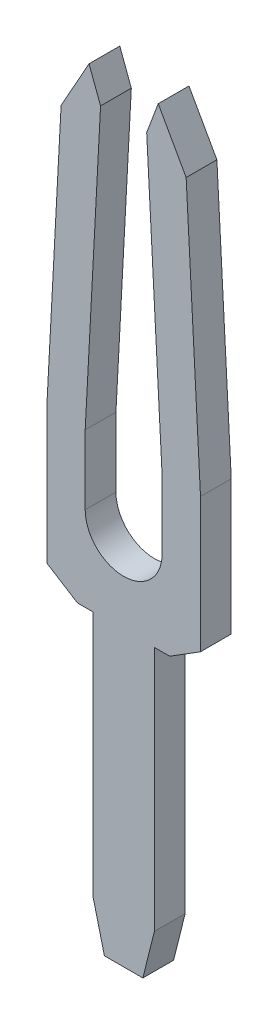
ISO-10303-21;
HEADER;
FILE_DESCRIPTION(('STEP AP214'),'2;1');
FILE_NAME('part.step','',(''),(''),'','','');
FILE_SCHEMA(('AUTOMOTIVE_DESIGN { 1 0 10303 214 1 1 1 1 }'));
ENDSEC;
DATA;
#1=APPLICATION_CONTEXT('core data for automotive mechanical design processes');
#2=APPLICATION_PROTOCOL_DEFINITION('international standard','automotive_design',2000,#1);
#3=PRODUCT_CONTEXT('',#1,'mechanical');
#4=PRODUCT('Part','Part','',(#3));
#5=PRODUCT_RELATED_PRODUCT_CATEGORY('part','',(#4));
#6=PRODUCT_DEFINITION_FORMATION('','',#4);
#7=PRODUCT_DEFINITION_CONTEXT('part definition',#1,'design');
#8=PRODUCT_DEFINITION('design','',#6,#7);
#9=PRODUCT_DEFINITION_SHAPE('','',#8);
#10=(LENGTH_UNIT() NAMED_UNIT(*) SI_UNIT(.MILLI.,.METRE.));
#11=(NAMED_UNIT(*) PLANE_ANGLE_UNIT() SI_UNIT($,.RADIAN.));
#12=(NAMED_UNIT(*) SI_UNIT($,.STERADIAN.) SOLID_ANGLE_UNIT());
#13=UNCERTAINTY_MEASURE_WITH_UNIT(LENGTH_MEASURE(1.E-05),#10,'distance_accuracy_value','');
#14=(GEOMETRIC_REPRESENTATION_CONTEXT(3) GLOBAL_UNCERTAINTY_ASSIGNED_CONTEXT((#13)) GLOBAL_UNIT_ASSIGNED_CONTEXT((#10,
#11,#12)) REPRESENTATION_CONTEXT('',''));
#15=CARTESIAN_POINT('',(0.,0.,0.));
#16=DIRECTION('',(0.,0.,1.));
#17=DIRECTION('',(1.,0.,0.));
#18=AXIS2_PLACEMENT_3D('',#15,#16,#17);
#19=CARTESIAN_POINT('',(-0.25,-4.975,0.4));
#20=DIRECTION('',(0.,1.,0.));
#21=DIRECTION('',(0.,0.,1.));
#22=AXIS2_PLACEMENT_3D('',#19,#20,#21);
#23=PLANE('',#22);
#24=DIRECTION('',(1.,0.,0.));
#25=VECTOR('',#24,1.);
#26=CARTESIAN_POINT('',(-0.25,-4.975,0.));
#27=LINE('',#26,#25);
#28=CARTESIAN_POINT('',(-0.25,-4.975,0.));
#29=VERTEX_POINT('',#28);
#30=CARTESIAN_POINT('',(0.25,-4.975,0.));
#31=VERTEX_POINT('',#30);
#32=EDGE_CURVE('E213',#29,#31,#27,.T.);
#33=ORIENTED_EDGE('',*,*,#32,.T.);
#34=DIRECTION('',(0.,0.,-1.));
#35=VECTOR('',#34,1.);
#36=CARTESIAN_POINT('',(0.25,-4.975,0.4));
#37=LINE('',#36,#35);
#38=CARTESIAN_POINT('',(0.25,-4.975,0.4));
#39=VERTEX_POINT('',#38);
#40=EDGE_CURVE('E11',#39,#31,#37,.T.);
#41=ORIENTED_EDGE('',*,*,#40,.F.);
#42=DIRECTION('',(1.,0.,0.));
#43=VECTOR('',#42,1.);
#44=CARTESIAN_POINT('',(-0.25,-4.975,0.4));
#45=LINE('',#44,#43);
#46=CARTESIAN_POINT('',(-0.25,-4.975,0.4));
#47=VERTEX_POINT('',#46);
#48=EDGE_CURVE('E255',#47,#39,#45,.T.);
#49=ORIENTED_EDGE('',*,*,#48,.F.);
#50=DIRECTION('',(0.,0.,-1.));
#51=VECTOR('',#50,1.);
#52=CARTESIAN_POINT('',(-0.25,-4.975,0.4));
#53=LINE('',#52,#51);
#54=EDGE_CURVE('E209',#47,#29,#53,.T.);
#55=ORIENTED_EDGE('',*,*,#54,.T.);
#56=EDGE_LOOP('',(#33,#41,#49,#55));
#57=FACE_BOUND('',#56,.T.);
#58=ADVANCED_FACE('F33',(#57),#23,.F.);
#59=CARTESIAN_POINT('',(0.25,-4.975,0.4));
#60=DIRECTION('',(-0.970142500145333,0.242535625036329,0.));
#61=DIRECTION('',(-0.242535625036329,-0.970142500145333,0.));
#62=AXIS2_PLACEMENT_3D('',#59,#60,#61);
#63=PLANE('',#62);
#64=DIRECTION('',(0.242535625036329,0.970142500145333,0.));
#65=VECTOR('',#64,1.);
#66=CARTESIAN_POINT('',(0.25,-4.975,0.));
#67=LINE('',#66,#65);
#68=CARTESIAN_POINT('',(0.399999999999998,-4.375,0.));
#69=VERTEX_POINT('',#68);
#70=EDGE_CURVE('E216',#31,#69,#67,.T.);
#71=ORIENTED_EDGE('',*,*,#70,.T.);
#72=DIRECTION('',(0.,0.,-1.));
#73=VECTOR('',#72,1.);
#74=CARTESIAN_POINT('',(0.399999999999998,-4.375,0.4));
#75=LINE('',#74,#73);
#76=CARTESIAN_POINT('',(0.399999999999998,-4.375,0.4));
#77=VERTEX_POINT('',#76);
#78=EDGE_CURVE('E41',#77,#69,#75,.T.);
#79=ORIENTED_EDGE('',*,*,#78,.F.);
#80=DIRECTION('',(0.242535625036329,0.970142500145333,0.));
#81=VECTOR('',#80,1.);
#82=CARTESIAN_POINT('',(0.25,-4.975,0.4));
#83=LINE('',#82,#81);
#84=EDGE_CURVE('E134',#39,#77,#83,.T.);
#85=ORIENTED_EDGE('',*,*,#84,.F.);
#86=ORIENTED_EDGE('',*,*,#40,.T.);
#87=EDGE_LOOP('',(#71,#79,#85,#86));
#88=FACE_BOUND('',#87,.T.);
#89=ADVANCED_FACE('F383',(#88),#63,.F.);
#90=CARTESIAN_POINT('',(0.399999999999998,-4.375,0.4));
#91=DIRECTION('',(-1.,0.,0.));
#92=DIRECTION('',(0.,0.,1.));
#93=AXIS2_PLACEMENT_3D('',#90,#91,#92);
#94=PLANE('',#93);
#95=DIRECTION('',(0.,1.,0.));
#96=VECTOR('',#95,1.);
#97=CARTESIAN_POINT('',(0.399999999999998,-4.375,0.));
#98=LINE('',#97,#96);
#99=CARTESIAN_POINT('',(0.399999999999998,-1.175,0.));
#100=VERTEX_POINT('',#99);
#101=EDGE_CURVE('E218',#69,#100,#98,.T.);
#102=ORIENTED_EDGE('',*,*,#101,.T.);
#103=DIRECTION('',(0.,0.,-1.));
#104=VECTOR('',#103,1.);
#105=CARTESIAN_POINT('',(0.399999999999998,-1.175,0.4));
#106=LINE('',#105,#104);
#107=CARTESIAN_POINT('',(0.399999999999998,-1.175,0.4));
#108=VERTEX_POINT('',#107);
#109=EDGE_CURVE('E304',#108,#100,#106,.T.);
#110=ORIENTED_EDGE('',*,*,#109,.F.);
#111=DIRECTION('',(0.,1.,0.));
#112=VECTOR('',#111,1.);
#113=CARTESIAN_POINT('',(0.399999999999998,-4.375,0.4));
#114=LINE('',#113,#112);
#115=EDGE_CURVE('E312',#77,#108,#114,.T.);
#116=ORIENTED_EDGE('',*,*,#115,.F.);
#117=ORIENTED_EDGE('',*,*,#78,.T.);
#118=EDGE_LOOP('',(#102,#110,#116,#117));
#119=FACE_BOUND('',#118,.T.);
#120=ADVANCED_FACE('F310',(#119),#94,.F.);
#121=CARTESIAN_POINT('',(0.399999999999998,-1.175,0.4));
#122=DIRECTION('',(0.,1.,0.));
#123=DIRECTION('',(0.,0.,1.));
#124=AXIS2_PLACEMENT_3D('',#121,#122,#123);
#125=PLANE('',#124);
#126=DIRECTION('',(1.,0.,0.));
#127=VECTOR('',#126,1.);
#128=CARTESIAN_POINT('',(0.399999999999998,-1.175,0.));
#129=LINE('',#128,#127);
#130=CARTESIAN_POINT('',(0.600000000000003,-1.175,0.));
#131=VERTEX_POINT('',#130);
#132=EDGE_CURVE('E220',#100,#131,#129,.T.);
#133=ORIENTED_EDGE('',*,*,#132,.T.);
#134=DIRECTION('',(0.,0.,-1.));
#135=VECTOR('',#134,1.);
#136=CARTESIAN_POINT('',(0.600000000000003,-1.175,0.4));
#137=LINE('',#136,#135);
#138=CARTESIAN_POINT('',(0.600000000000003,-1.175,0.4));
#139=VERTEX_POINT('',#138);
#140=EDGE_CURVE('E301',#139,#131,#137,.T.);
#141=ORIENTED_EDGE('',*,*,#140,.F.);
#142=DIRECTION('',(1.,0.,0.));
#143=VECTOR('',#142,1.);
#144=CARTESIAN_POINT('',(0.399999999999998,-1.175,0.4));
#145=LINE('',#144,#143);
#146=EDGE_CURVE('E330',#108,#139,#145,.T.);
#147=ORIENTED_EDGE('',*,*,#146,.F.);
#148=ORIENTED_EDGE('',*,*,#109,.T.);
#149=EDGE_LOOP('',(#133,#141,#147,#148));
#150=FACE_BOUND('',#149,.T.);
#151=ADVANCED_FACE('F321',(#150),#125,.F.);
#152=CARTESIAN_POINT('',(0.600000000000003,-1.175,0.4));
#153=DIRECTION('',(-0.529998940003182,0.847998304005086,0.));
#154=DIRECTION('',(-0.847998304005087,-0.529998940003182,0.));
#155=AXIS2_PLACEMENT_3D('',#152,#153,#154);
#156=PLANE('',#155);
#157=DIRECTION('',(0.847998304005086,0.529998940003182,0.));
#158=VECTOR('',#157,1.);
#159=CARTESIAN_POINT('',(0.600000000000003,-1.175,0.));
#160=LINE('',#159,#158);
#161=CARTESIAN_POINT('',(1.,-0.925,0.));
#162=VERTEX_POINT('',#161);
#163=EDGE_CURVE('E222',#131,#162,#160,.T.);
#164=ORIENTED_EDGE('',*,*,#163,.T.);
#165=DIRECTION('',(0.,0.,-1.));
#166=VECTOR('',#165,1.);
#167=CARTESIAN_POINT('',(1.,-0.925,0.4));
#168=LINE('',#167,#166);
#169=CARTESIAN_POINT('',(1.,-0.925,0.4));
#170=VERTEX_POINT('',#169);
#171=EDGE_CURVE('E298',#170,#162,#168,.T.);
#172=ORIENTED_EDGE('',*,*,#171,.F.);
#173=DIRECTION('',(0.847998304005086,0.529998940003182,0.));
#174=VECTOR('',#173,1.);
#175=CARTESIAN_POINT('',(0.600000000000003,-1.175,0.4));
#176=LINE('',#175,#174);
#177=EDGE_CURVE('E327',#139,#170,#176,.T.);
#178=ORIENTED_EDGE('',*,*,#177,.F.);
#179=ORIENTED_EDGE('',*,*,#140,.T.);
#180=EDGE_LOOP('',(#164,#172,#178,#179));
#181=FACE_BOUND('',#180,.T.);
#182=ADVANCED_FACE('F325',(#181),#156,.F.);
#183=CARTESIAN_POINT('',(1.,-0.925,0.4));
#184=DIRECTION('',(-1.,0.,0.));
#185=DIRECTION('',(0.,0.,1.));
#186=AXIS2_PLACEMENT_3D('',#183,#184,#185);
#187=PLANE('',#186);
#188=DIRECTION('',(0.,1.,0.));
#189=VECTOR('',#188,1.);
#190=CARTESIAN_POINT('',(1.,-0.925,0.));
#191=LINE('',#190,#189);
#192=CARTESIAN_POINT('',(1.,0.825,0.));
#193=VERTEX_POINT('',#192);
#194=EDGE_CURVE('E224',#162,#193,#191,.T.);
#195=ORIENTED_EDGE('',*,*,#194,.T.);
#196=DIRECTION('',(0.,0.,-1.));
#197=VECTOR('',#196,1.);
#198=CARTESIAN_POINT('',(1.,0.825,0.4));
#199=LINE('',#198,#197);
#200=CARTESIAN_POINT('',(1.,0.825,0.4));
#201=VERTEX_POINT('',#200);
#202=EDGE_CURVE('E295',#201,#193,#199,.T.);
#203=ORIENTED_EDGE('',*,*,#202,.F.);
#204=DIRECTION('',(0.,1.,0.));
#205=VECTOR('',#204,1.);
#206=CARTESIAN_POINT('',(1.,-0.925,0.4));
#207=LINE('',#206,#205);
#208=EDGE_CURVE('E329',#170,#201,#207,.T.);
#209=ORIENTED_EDGE('',*,*,#208,.F.);
#210=ORIENTED_EDGE('',*,*,#171,.T.);
#211=EDGE_LOOP('',(#195,#203,#209,#210));
#212=FACE_BOUND('',#211,.T.);
#213=ADVANCED_FACE('F396',(#212),#187,.F.);
#214=CARTESIAN_POINT('',(1.,0.825,0.4));
#215=DIRECTION('',(-0.998580804677827,-0.0532576429161334,0.));
#216=DIRECTION('',(0.0532576429161335,-0.998580804677828,0.));
#217=AXIS2_PLACEMENT_3D('',#214,#215,#216);
#218=PLANE('',#217);
#219=DIRECTION('',(-0.0532576429161335,0.998580804677828,0.));
#220=VECTOR('',#219,1.);
#221=CARTESIAN_POINT('',(1.,0.825,0.));
#222=LINE('',#221,#220);
#223=CARTESIAN_POINT('',(0.813333333333395,4.325,0.));
#224=VERTEX_POINT('',#223);
#225=EDGE_CURVE('E226',#193,#224,#222,.T.);
#226=ORIENTED_EDGE('',*,*,#225,.T.);
#227=DIRECTION('',(0.,0.,-1.));
#228=VECTOR('',#227,1.);
#229=CARTESIAN_POINT('',(0.813333333333395,4.325,0.4));
#230=LINE('',#229,#228);
#231=CARTESIAN_POINT('',(0.813333333333395,4.325,0.4));
#232=VERTEX_POINT('',#231);
#233=EDGE_CURVE('E292',#232,#224,#230,.T.);
#234=ORIENTED_EDGE('',*,*,#233,.F.);
#235=DIRECTION('',(-0.0532576429161335,0.998580804677828,0.));
#236=VECTOR('',#235,1.);
#237=CARTESIAN_POINT('',(1.,0.825,0.4));
#238=LINE('',#237,#236);
#239=EDGE_CURVE('E332',#201,#232,#238,.T.);
#240=ORIENTED_EDGE('',*,*,#239,.F.);
#241=ORIENTED_EDGE('',*,*,#202,.T.);
#242=EDGE_LOOP('',(#226,#234,#240,#241));
#243=FACE_BOUND('',#242,.T.);
#244=ADVANCED_FACE('F399',(#243),#218,.F.);
#245=CARTESIAN_POINT('',(0.813333333333395,4.325,0.4));
#246=DIRECTION('',(-0.872887411396182,-0.487921681242053,0.));
#247=DIRECTION('',(0.487921681242053,-0.872887411396182,0.));
#248=AXIS2_PLACEMENT_3D('',#245,#246,#247);
#249=PLANE('',#248);
#250=DIRECTION('',(-0.487921681242053,0.872887411396182,0.));
#251=VECTOR('',#250,1.);
#252=CARTESIAN_POINT('',(0.813333333333395,4.325,0.));
#253=LINE('',#252,#251);
#254=CARTESIAN_POINT('',(0.449999999999999,4.975,0.));
#255=VERTEX_POINT('',#254);
#256=EDGE_CURVE('E228',#224,#255,#253,.T.);
#257=ORIENTED_EDGE('',*,*,#256,.T.);
#258=DIRECTION('',(0.,0.,-1.));
#259=VECTOR('',#258,1.);
#260=CARTESIAN_POINT('',(0.449999999999999,4.975,0.4));
#261=LINE('',#260,#259);
#262=CARTESIAN_POINT('',(0.449999999999999,4.975,0.4));
#263=VERTEX_POINT('',#262);
#264=EDGE_CURVE('E289',#263,#255,#261,.T.);
#265=ORIENTED_EDGE('',*,*,#264,.F.);
#266=DIRECTION('',(-0.487921681242053,0.872887411396182,0.));
#267=VECTOR('',#266,1.);
#268=CARTESIAN_POINT('',(0.813333333333395,4.325,0.4));
#269=LINE('',#268,#267);
#270=EDGE_CURVE('E338',#232,#263,#269,.T.);
#271=ORIENTED_EDGE('',*,*,#270,.F.);
#272=ORIENTED_EDGE('',*,*,#233,.T.);
#273=EDGE_LOOP('',(#257,#265,#271,#272));
#274=FACE_BOUND('',#273,.T.);
#275=ADVANCED_FACE('F403',(#274),#249,.F.);
#276=CARTESIAN_POINT('',(0.449999999999999,4.975,0.4));
#277=DIRECTION('',(0.936329177569047,-0.351123441588386,0.));
#278=DIRECTION('',(0.351123441588386,0.936329177569047,0.));
#279=AXIS2_PLACEMENT_3D('',#276,#277,#278);
#280=PLANE('',#279);
#281=DIRECTION('',(-0.351123441588386,-0.936329177569047,0.));
#282=VECTOR('',#281,1.);
#283=CARTESIAN_POINT('',(0.449999999999999,4.975,0.));
#284=LINE('',#283,#282);
#285=CARTESIAN_POINT('',(0.300000000000002,4.575,0.));
#286=VERTEX_POINT('',#285);
#287=EDGE_CURVE('E230',#255,#286,#284,.T.);
#288=ORIENTED_EDGE('',*,*,#287,.T.);
#289=DIRECTION('',(0.,0.,-1.));
#290=VECTOR('',#289,1.);
#291=CARTESIAN_POINT('',(0.300000000000002,4.575,0.4));
#292=LINE('',#291,#290);
#293=CARTESIAN_POINT('',(0.300000000000002,4.575,0.4));
#294=VERTEX_POINT('',#293);
#295=EDGE_CURVE('E286',#294,#286,#292,.T.);
#296=ORIENTED_EDGE('',*,*,#295,.F.);
#297=DIRECTION('',(-0.351123441588386,-0.936329177569047,0.));
#298=VECTOR('',#297,1.);
#299=CARTESIAN_POINT('',(0.449999999999999,4.975,0.4));
#300=LINE('',#299,#298);
#301=EDGE_CURVE('E340',#263,#294,#300,.T.);
#302=ORIENTED_EDGE('',*,*,#301,.F.);
#303=ORIENTED_EDGE('',*,*,#264,.T.);
#304=EDGE_LOOP('',(#288,#296,#302,#303));
#305=FACE_BOUND('',#304,.T.);
#306=ADVANCED_FACE('F407',(#305),#280,.F.);
#307=CARTESIAN_POINT('',(0.300000000000002,4.575,0.4));
#308=DIRECTION('',(0.998580804677827,0.0532576429161504,0.));
#309=DIRECTION('',(-0.0532576429161504,0.998580804677827,0.));
#310=AXIS2_PLACEMENT_3D('',#307,#308,#309);
#311=PLANE('',#310);
#312=DIRECTION('',(0.0532576429161504,-0.998580804677827,0.));
#313=VECTOR('',#312,1.);
#314=CARTESIAN_POINT('',(0.300000000000002,4.575,0.));
#315=LINE('',#314,#313);
#316=CARTESIAN_POINT('',(0.5,0.825,0.));
#317=VERTEX_POINT('',#316);
#318=EDGE_CURVE('E232',#286,#317,#315,.T.);
#319=ORIENTED_EDGE('',*,*,#318,.T.);
#320=DIRECTION('',(0.,0.,-1.));
#321=VECTOR('',#320,1.);
#322=CARTESIAN_POINT('',(0.5,0.825,0.4));
#323=LINE('',#322,#321);
#324=CARTESIAN_POINT('',(0.5,0.825,0.4));
#325=VERTEX_POINT('',#324);
#326=EDGE_CURVE('E283',#325,#317,#323,.T.);
#327=ORIENTED_EDGE('',*,*,#326,.F.);
#328=DIRECTION('',(0.0532576429161504,-0.998580804677827,0.));
#329=VECTOR('',#328,1.);
#330=CARTESIAN_POINT('',(0.300000000000002,4.575,0.4));
#331=LINE('',#330,#329);
#332=EDGE_CURVE('E342',#294,#325,#331,.T.);
#333=ORIENTED_EDGE('',*,*,#332,.F.);
#334=ORIENTED_EDGE('',*,*,#295,.T.);
#335=EDGE_LOOP('',(#319,#327,#333,#334));
#336=FACE_BOUND('',#335,.T.);
#337=ADVANCED_FACE('F411',(#336),#311,.F.);
#338=CARTESIAN_POINT('',(0.5,0.825,0.4));
#339=DIRECTION('',(1.,0.,0.));
#340=DIRECTION('',(0.,0.,-1.));
#341=AXIS2_PLACEMENT_3D('',#338,#339,#340);
#342=PLANE('',#341);
#343=DIRECTION('',(0.,-1.,0.));
#344=VECTOR('',#343,1.);
#345=CARTESIAN_POINT('',(0.5,0.825,0.));
#346=LINE('',#345,#344);
#347=CARTESIAN_POINT('',(0.5,-0.075,0.));
#348=VERTEX_POINT('',#347);
#349=EDGE_CURVE('E234',#317,#348,#346,.T.);
#350=ORIENTED_EDGE('',*,*,#349,.T.);
#351=DIRECTION('',(0.,0.,-1.));
#352=VECTOR('',#351,1.);
#353=CARTESIAN_POINT('',(0.5,-0.075,0.4));
#354=LINE('',#353,#352);
#355=CARTESIAN_POINT('',(0.5,-0.075,0.4));
#356=VERTEX_POINT('',#355);
#357=EDGE_CURVE('E280',#356,#348,#354,.T.);
#358=ORIENTED_EDGE('',*,*,#357,.F.);
#359=DIRECTION('',(0.,-1.,0.));
#360=VECTOR('',#359,1.);
#361=CARTESIAN_POINT('',(0.5,0.825,0.4));
#362=LINE('',#361,#360);
#363=EDGE_CURVE('E344',#325,#356,#362,.T.);
#364=ORIENTED_EDGE('',*,*,#363,.F.);
#365=ORIENTED_EDGE('',*,*,#326,.T.);
#366=EDGE_LOOP('',(#350,#358,#364,#365));
#367=FACE_BOUND('',#366,.T.);
#368=ADVANCED_FACE('F415',(#367),#342,.F.);
#369=CARTESIAN_POINT('',(0.,-0.075,0.4));
#370=DIRECTION('',(0.,0.,-1.));
#371=DIRECTION('',(-1.,0.,0.));
#372=AXIS2_PLACEMENT_3D('',#369,#370,#371);
#373=CYLINDRICAL_SURFACE('',#372,0.5);
#374=CARTESIAN_POINT('',(0.,-0.075,0.));
#375=DIRECTION('',(0.,0.,-1.));
#376=DIRECTION('',(1.,0.,0.));
#377=AXIS2_PLACEMENT_3D('',#374,#375,#376);
#378=CIRCLE('',#377,0.5);
#379=CARTESIAN_POINT('',(-0.5,-0.0749999999999999,0.));
#380=VERTEX_POINT('',#379);
#381=EDGE_CURVE('E236',#348,#380,#378,.T.);
#382=ORIENTED_EDGE('',*,*,#381,.T.);
#383=DIRECTION('',(0.,0.,-1.));
#384=VECTOR('',#383,1.);
#385=CARTESIAN_POINT('',(-0.5,-0.0749999999999999,0.4));
#386=LINE('',#385,#384);
#387=CARTESIAN_POINT('',(-0.5,-0.0749999999999999,0.4));
#388=VERTEX_POINT('',#387);
#389=EDGE_CURVE('E277',#388,#380,#386,.T.);
#390=ORIENTED_EDGE('',*,*,#389,.F.);
#391=CARTESIAN_POINT('',(0.,-0.075,0.4));
#392=DIRECTION('',(0.,0.,-1.));
#393=DIRECTION('',(1.,0.,0.));
#394=AXIS2_PLACEMENT_3D('',#391,#392,#393);
#395=CIRCLE('',#394,0.5);
#396=EDGE_CURVE('E346',#356,#388,#395,.T.);
#397=ORIENTED_EDGE('',*,*,#396,.F.);
#398=ORIENTED_EDGE('',*,*,#357,.T.);
#399=EDGE_LOOP('',(#382,#390,#397,#398));
#400=FACE_BOUND('',#399,.T.);
#401=ADVANCED_FACE('F419',(#400),#373,.F.);
#402=CARTESIAN_POINT('',(-0.5,-0.075,0.4));
#403=DIRECTION('',(-1.,0.,0.));
#404=DIRECTION('',(0.,0.,1.));
#405=AXIS2_PLACEMENT_3D('',#402,#403,#404);
#406=PLANE('',#405);
#407=DIRECTION('',(0.,1.,0.));
#408=VECTOR('',#407,1.);
#409=CARTESIAN_POINT('',(-0.5,-0.075,0.));
#410=LINE('',#409,#408);
#411=CARTESIAN_POINT('',(-0.5,0.825,0.));
#412=VERTEX_POINT('',#411);
#413=EDGE_CURVE('E238',#380,#412,#410,.T.);
#414=ORIENTED_EDGE('',*,*,#413,.T.);
#415=DIRECTION('',(0.,0.,-1.));
#416=VECTOR('',#415,1.);
#417=CARTESIAN_POINT('',(-0.5,0.825,0.4));
#418=LINE('',#417,#416);
#419=CARTESIAN_POINT('',(-0.5,0.825,0.4));
#420=VERTEX_POINT('',#419);
#421=EDGE_CURVE('E274',#420,#412,#418,.T.);
#422=ORIENTED_EDGE('',*,*,#421,.F.);
#423=DIRECTION('',(0.,1.,0.));
#424=VECTOR('',#423,1.);
#425=CARTESIAN_POINT('',(-0.5,-0.075,0.4));
#426=LINE('',#425,#424);
#427=EDGE_CURVE('E348',#388,#420,#426,.T.);
#428=ORIENTED_EDGE('',*,*,#427,.F.);
#429=ORIENTED_EDGE('',*,*,#389,.T.);
#430=EDGE_LOOP('',(#414,#422,#428,#429));
#431=FACE_BOUND('',#430,.T.);
#432=ADVANCED_FACE('F423',(#431),#406,.F.);
#433=CARTESIAN_POINT('',(-0.5,0.825,0.4));
#434=DIRECTION('',(-0.998580804677827,0.0532576429161504,0.));
#435=DIRECTION('',(-0.0532576429161504,-0.998580804677827,0.));
#436=AXIS2_PLACEMENT_3D('',#433,#434,#435);
#437=PLANE('',#436);
#438=DIRECTION('',(0.0532576429161504,0.998580804677827,0.));
#439=VECTOR('',#438,1.);
#440=CARTESIAN_POINT('',(-0.5,0.825,0.));
#441=LINE('',#440,#439);
#442=CARTESIAN_POINT('',(-0.300000000000002,4.575,0.));
#443=VERTEX_POINT('',#442);
#444=EDGE_CURVE('E240',#412,#443,#441,.T.);
#445=ORIENTED_EDGE('',*,*,#444,.T.);
#446=DIRECTION('',(0.,0.,-1.));
#447=VECTOR('',#446,1.);
#448=CARTESIAN_POINT('',(-0.300000000000002,4.575,0.4));
#449=LINE('',#448,#447);
#450=CARTESIAN_POINT('',(-0.300000000000002,4.575,0.4));
#451=VERTEX_POINT('',#450);
#452=EDGE_CURVE('E271',#451,#443,#449,.T.);
#453=ORIENTED_EDGE('',*,*,#452,.F.);
#454=DIRECTION('',(0.0532576429161504,0.998580804677827,0.));
#455=VECTOR('',#454,1.);
#456=CARTESIAN_POINT('',(-0.5,0.825,0.4));
#457=LINE('',#456,#455);
#458=EDGE_CURVE('E350',#420,#451,#457,.T.);
#459=ORIENTED_EDGE('',*,*,#458,.F.);
#460=ORIENTED_EDGE('',*,*,#421,.T.);
#461=EDGE_LOOP('',(#445,#453,#459,#460));
#462=FACE_BOUND('',#461,.T.);
#463=ADVANCED_FACE('F427',(#462),#437,.F.);
#464=CARTESIAN_POINT('',(-0.300000000000002,4.575,0.4));
#465=DIRECTION('',(-0.936329177569047,-0.351123441588386,0.));
#466=DIRECTION('',(0.351123441588386,-0.936329177569047,0.));
#467=AXIS2_PLACEMENT_3D('',#464,#465,#466);
#468=PLANE('',#467);
#469=DIRECTION('',(-0.351123441588386,0.936329177569047,0.));
#470=VECTOR('',#469,1.);
#471=CARTESIAN_POINT('',(-0.300000000000002,4.575,0.));
#472=LINE('',#471,#470);
#473=CARTESIAN_POINT('',(-0.449999999999999,4.975,0.));
#474=VERTEX_POINT('',#473);
#475=EDGE_CURVE('E242',#443,#474,#472,.T.);
#476=ORIENTED_EDGE('',*,*,#475,.T.);
#477=DIRECTION('',(0.,0.,-1.));
#478=VECTOR('',#477,1.);
#479=CARTESIAN_POINT('',(-0.449999999999999,4.975,0.4));
#480=LINE('',#479,#478);
#481=CARTESIAN_POINT('',(-0.449999999999999,4.975,0.4));
#482=VERTEX_POINT('',#481);
#483=EDGE_CURVE('E268',#482,#474,#480,.T.);
#484=ORIENTED_EDGE('',*,*,#483,.F.);
#485=DIRECTION('',(-0.351123441588386,0.936329177569047,0.));
#486=VECTOR('',#485,1.);
#487=CARTESIAN_POINT('',(-0.300000000000002,4.575,0.4));
#488=LINE('',#487,#486);
#489=EDGE_CURVE('E352',#451,#482,#488,.T.);
#490=ORIENTED_EDGE('',*,*,#489,.F.);
#491=ORIENTED_EDGE('',*,*,#452,.T.);
#492=EDGE_LOOP('',(#476,#484,#490,#491));
#493=FACE_BOUND('',#492,.T.);
#494=ADVANCED_FACE('F431',(#493),#468,.F.);
#495=CARTESIAN_POINT('',(-0.449999999999999,4.975,0.4));
#496=DIRECTION('',(0.872887411396234,-0.487921681241961,0.));
#497=DIRECTION('',(0.487921681241961,0.872887411396234,0.));
#498=AXIS2_PLACEMENT_3D('',#495,#496,#497);
#499=PLANE('',#498);
#500=DIRECTION('',(-0.487921681241961,-0.872887411396234,0.));
#501=VECTOR('',#500,1.);
#502=CARTESIAN_POINT('',(-0.449999999999999,4.975,0.));
#503=LINE('',#502,#501);
#504=CARTESIAN_POINT('',(-0.813333333333305,4.325,0.));
#505=VERTEX_POINT('',#504);
#506=EDGE_CURVE('E244',#474,#505,#503,.T.);
#507=ORIENTED_EDGE('',*,*,#506,.T.);
#508=DIRECTION('',(0.,0.,-1.));
#509=VECTOR('',#508,1.);
#510=CARTESIAN_POINT('',(-0.813333333333305,4.325,0.4));
#511=LINE('',#510,#509);
#512=CARTESIAN_POINT('',(-0.813333333333305,4.325,0.4));
#513=VERTEX_POINT('',#512);
#514=EDGE_CURVE('E265',#513,#505,#511,.T.);
#515=ORIENTED_EDGE('',*,*,#514,.F.);
#516=DIRECTION('',(-0.487921681241961,-0.872887411396234,0.));
#517=VECTOR('',#516,1.);
#518=CARTESIAN_POINT('',(-0.449999999999999,4.975,0.4));
#519=LINE('',#518,#517);
#520=EDGE_CURVE('E354',#482,#513,#519,.T.);
#521=ORIENTED_EDGE('',*,*,#520,.F.);
#522=ORIENTED_EDGE('',*,*,#483,.T.);
#523=EDGE_LOOP('',(#507,#515,#521,#522));
#524=FACE_BOUND('',#523,.T.);
#525=ADVANCED_FACE('F435',(#524),#499,.F.);
#526=CARTESIAN_POINT('',(-0.813333333333305,4.325,0.4));
#527=DIRECTION('',(0.998580804677826,-0.0532576429161591,0.));
#528=DIRECTION('',(0.0532576429161591,0.998580804677826,0.));
#529=AXIS2_PLACEMENT_3D('',#526,#527,#528);
#530=PLANE('',#529);
#531=DIRECTION('',(-0.0532576429161591,-0.998580804677826,0.));
#532=VECTOR('',#531,1.);
#533=CARTESIAN_POINT('',(-0.813333333333305,4.325,0.));
#534=LINE('',#533,#532);
#535=CARTESIAN_POINT('',(-1.,0.825,0.));
#536=VERTEX_POINT('',#535);
#537=EDGE_CURVE('E246',#505,#536,#534,.T.);
#538=ORIENTED_EDGE('',*,*,#537,.T.);
#539=DIRECTION('',(0.,0.,-1.));
#540=VECTOR('',#539,1.);
#541=CARTESIAN_POINT('',(-1.,0.825,0.4));
#542=LINE('',#541,#540);
#543=CARTESIAN_POINT('',(-1.,0.825,0.4));
#544=VERTEX_POINT('',#543);
#545=EDGE_CURVE('E262',#544,#536,#542,.T.);
#546=ORIENTED_EDGE('',*,*,#545,.F.);
#547=DIRECTION('',(-0.0532576429161591,-0.998580804677826,0.));
#548=VECTOR('',#547,1.);
#549=CARTESIAN_POINT('',(-0.813333333333305,4.325,0.4));
#550=LINE('',#549,#548);
#551=EDGE_CURVE('E356',#513,#544,#550,.T.);
#552=ORIENTED_EDGE('',*,*,#551,.F.);
#553=ORIENTED_EDGE('',*,*,#514,.T.);
#554=EDGE_LOOP('',(#538,#546,#552,#553));
#555=FACE_BOUND('',#554,.T.);
#556=ADVANCED_FACE('F439',(#555),#530,.F.);
#557=CARTESIAN_POINT('',(-1.,0.825,0.4));
#558=DIRECTION('',(1.,0.,0.));
#559=DIRECTION('',(0.,0.,-1.));
#560=AXIS2_PLACEMENT_3D('',#557,#558,#559);
#561=PLANE('',#560);
#562=DIRECTION('',(0.,-1.,0.));
#563=VECTOR('',#562,1.);
#564=CARTESIAN_POINT('',(-1.,0.825,0.));
#565=LINE('',#564,#563);
#566=CARTESIAN_POINT('',(-1.,-0.925,0.));
#567=VERTEX_POINT('',#566);
#568=EDGE_CURVE('E248',#536,#567,#565,.T.);
#569=ORIENTED_EDGE('',*,*,#568,.T.);
#570=DIRECTION('',(0.,0.,-1.));
#571=VECTOR('',#570,1.);
#572=CARTESIAN_POINT('',(-1.,-0.925,0.4));
#573=LINE('',#572,#571);
#574=CARTESIAN_POINT('',(-1.,-0.925,0.4));
#575=VERTEX_POINT('',#574);
#576=EDGE_CURVE('E259',#575,#567,#573,.T.);
#577=ORIENTED_EDGE('',*,*,#576,.F.);
#578=DIRECTION('',(0.,-1.,0.));
#579=VECTOR('',#578,1.);
#580=CARTESIAN_POINT('',(-1.,0.825,0.4));
#581=LINE('',#580,#579);
#582=EDGE_CURVE('E358',#544,#575,#581,.T.);
#583=ORIENTED_EDGE('',*,*,#582,.F.);
#584=ORIENTED_EDGE('',*,*,#545,.T.);
#585=EDGE_LOOP('',(#569,#577,#583,#584));
#586=FACE_BOUND('',#585,.T.);
#587=ADVANCED_FACE('F364',(#586),#561,.F.);
#588=CARTESIAN_POINT('',(-1.,-0.925,0.4));
#589=DIRECTION('',(0.529998940003182,0.847998304005086,0.));
#590=DIRECTION('',(-0.847998304005087,0.529998940003182,0.));
#591=AXIS2_PLACEMENT_3D('',#588,#589,#590);
#592=PLANE('',#591);
#593=DIRECTION('',(0.847998304005086,-0.529998940003182,0.));
#594=VECTOR('',#593,1.);
#595=CARTESIAN_POINT('',(-1.,-0.925,0.));
#596=LINE('',#595,#594);
#597=CARTESIAN_POINT('',(-0.600000000000003,-1.175,0.));
#598=VERTEX_POINT('',#597);
#599=EDGE_CURVE('E250',#567,#598,#596,.T.);
#600=ORIENTED_EDGE('',*,*,#599,.T.);
#601=DIRECTION('',(0.,0.,-1.));
#602=VECTOR('',#601,1.);
#603=CARTESIAN_POINT('',(-0.600000000000003,-1.175,0.4));
#604=LINE('',#603,#602);
#605=CARTESIAN_POINT('',(-0.600000000000003,-1.175,0.4));
#606=VERTEX_POINT('',#605);
#607=EDGE_CURVE('E204',#606,#598,#604,.T.);
#608=ORIENTED_EDGE('',*,*,#607,.F.);
#609=DIRECTION('',(0.847998304005086,-0.529998940003182,0.));
#610=VECTOR('',#609,1.);
#611=CARTESIAN_POINT('',(-1.,-0.925,0.4));
#612=LINE('',#611,#610);
#613=EDGE_CURVE('E195',#575,#606,#612,.T.);
#614=ORIENTED_EDGE('',*,*,#613,.F.);
#615=ORIENTED_EDGE('',*,*,#576,.T.);
#616=EDGE_LOOP('',(#600,#608,#614,#615));
#617=FACE_BOUND('',#616,.T.);
#618=ADVANCED_FACE('F368',(#617),#592,.F.);
#619=CARTESIAN_POINT('',(-0.600000000000003,-1.175,0.4));
#620=DIRECTION('',(0.,1.,0.));
#621=DIRECTION('',(0.,0.,1.));
#622=AXIS2_PLACEMENT_3D('',#619,#620,#621);
#623=PLANE('',#622);
#624=DIRECTION('',(1.,0.,0.));
#625=VECTOR('',#624,1.);
#626=CARTESIAN_POINT('',(-0.600000000000003,-1.175,0.));
#627=LINE('',#626,#625);
#628=CARTESIAN_POINT('',(-0.399999999999998,-1.175,0.));
#629=VERTEX_POINT('',#628);
#630=EDGE_CURVE('E203',#598,#629,#627,.T.);
#631=ORIENTED_EDGE('',*,*,#630,.T.);
#632=DIRECTION('',(0.,0.,-1.));
#633=VECTOR('',#632,1.);
#634=CARTESIAN_POINT('',(-0.399999999999998,-1.175,0.4));
#635=LINE('',#634,#633);
#636=CARTESIAN_POINT('',(-0.399999999999998,-1.175,0.4));
#637=VERTEX_POINT('',#636);
#638=EDGE_CURVE('E200',#637,#629,#635,.T.);
#639=ORIENTED_EDGE('',*,*,#638,.F.);
#640=DIRECTION('',(1.,0.,0.));
#641=VECTOR('',#640,1.);
#642=CARTESIAN_POINT('',(-0.600000000000003,-1.175,0.4));
#643=LINE('',#642,#641);
#644=EDGE_CURVE('E189',#606,#637,#643,.T.);
#645=ORIENTED_EDGE('',*,*,#644,.F.);
#646=ORIENTED_EDGE('',*,*,#607,.T.);
#647=EDGE_LOOP('',(#631,#639,#645,#646));
#648=FACE_BOUND('',#647,.T.);
#649=ADVANCED_FACE('F201',(#648),#623,.F.);
#650=CARTESIAN_POINT('',(-0.399999999999998,-1.175,0.4));
#651=DIRECTION('',(1.,0.,0.));
#652=DIRECTION('',(0.,0.,-1.));
#653=AXIS2_PLACEMENT_3D('',#650,#651,#652);
#654=PLANE('',#653);
#655=DIRECTION('',(0.,-1.,0.));
#656=VECTOR('',#655,1.);
#657=CARTESIAN_POINT('',(-0.399999999999998,-1.175,0.));
#658=LINE('',#657,#656);
#659=CARTESIAN_POINT('',(-0.399999999999998,-4.375,0.));
#660=VERTEX_POINT('',#659);
#661=EDGE_CURVE('E120',#629,#660,#658,.T.);
#662=ORIENTED_EDGE('',*,*,#661,.T.);
#663=DIRECTION('',(0.,0.,-1.));
#664=VECTOR('',#663,1.);
#665=CARTESIAN_POINT('',(-0.399999999999998,-4.375,0.4));
#666=LINE('',#665,#664);
#667=CARTESIAN_POINT('',(-0.399999999999998,-4.375,0.4));
#668=VERTEX_POINT('',#667);
#669=EDGE_CURVE('E205',#668,#660,#666,.T.);
#670=ORIENTED_EDGE('',*,*,#669,.F.);
#671=DIRECTION('',(0.,-1.,0.));
#672=VECTOR('',#671,1.);
#673=CARTESIAN_POINT('',(-0.399999999999998,-1.175,0.4));
#674=LINE('',#673,#672);
#675=EDGE_CURVE('E193',#637,#668,#674,.T.);
#676=ORIENTED_EDGE('',*,*,#675,.F.);
#677=ORIENTED_EDGE('',*,*,#638,.T.);
#678=EDGE_LOOP('',(#662,#670,#676,#677));
#679=FACE_BOUND('',#678,.T.);
#680=ADVANCED_FACE('F207',(#679),#654,.F.);
#681=CARTESIAN_POINT('',(-0.399999999999998,-4.375,0.4));
#682=DIRECTION('',(0.970142500145333,0.242535625036329,0.));
#683=DIRECTION('',(-0.242535625036329,0.970142500145333,0.));
#684=AXIS2_PLACEMENT_3D('',#681,#682,#683);
#685=PLANE('',#684);
#686=DIRECTION('',(0.242535625036329,-0.970142500145333,0.));
#687=VECTOR('',#686,1.);
#688=CARTESIAN_POINT('',(-0.399999999999998,-4.375,0.));
#689=LINE('',#688,#687);
#690=EDGE_CURVE('E126',#660,#29,#689,.T.);
#691=ORIENTED_EDGE('',*,*,#690,.T.);
#692=ORIENTED_EDGE('',*,*,#54,.F.);
#693=DIRECTION('',(0.242535625036329,-0.970142500145333,0.));
#694=VECTOR('',#693,1.);
#695=CARTESIAN_POINT('',(-0.399999999999998,-4.375,0.4));
#696=LINE('',#695,#694);
#697=EDGE_CURVE('E49',#668,#47,#696,.T.);
#698=ORIENTED_EDGE('',*,*,#697,.F.);
#699=ORIENTED_EDGE('',*,*,#669,.T.);
#700=EDGE_LOOP('',(#691,#692,#698,#699));
#701=FACE_BOUND('',#700,.T.);
#702=ADVANCED_FACE('F372',(#701),#685,.F.);
#703=CARTESIAN_POINT('',(0.,-0.075,0.4));
#704=DIRECTION('',(0.,0.,1.));
#705=DIRECTION('',(1.,0.,0.));
#706=AXIS2_PLACEMENT_3D('',#703,#704,#705);
#707=PLANE('',#706);
#708=ORIENTED_EDGE('',*,*,#48,.T.);
#709=ORIENTED_EDGE('',*,*,#84,.T.);
#710=ORIENTED_EDGE('',*,*,#115,.T.);
#711=ORIENTED_EDGE('',*,*,#146,.T.);
#712=ORIENTED_EDGE('',*,*,#177,.T.);
#713=ORIENTED_EDGE('',*,*,#208,.T.);
#714=ORIENTED_EDGE('',*,*,#239,.T.);
#715=ORIENTED_EDGE('',*,*,#270,.T.);
#716=ORIENTED_EDGE('',*,*,#301,.T.);
#717=ORIENTED_EDGE('',*,*,#332,.T.);
#718=ORIENTED_EDGE('',*,*,#363,.T.);
#719=ORIENTED_EDGE('',*,*,#396,.T.);
#720=ORIENTED_EDGE('',*,*,#427,.T.);
#721=ORIENTED_EDGE('',*,*,#458,.T.);
#722=ORIENTED_EDGE('',*,*,#489,.T.);
#723=ORIENTED_EDGE('',*,*,#520,.T.);
#724=ORIENTED_EDGE('',*,*,#551,.T.);
#725=ORIENTED_EDGE('',*,*,#582,.T.);
#726=ORIENTED_EDGE('',*,*,#613,.T.);
#727=ORIENTED_EDGE('',*,*,#644,.T.);
#728=ORIENTED_EDGE('',*,*,#675,.T.);
#729=ORIENTED_EDGE('',*,*,#697,.T.);
#730=EDGE_LOOP('',(#708,#709,#710,#711,#712,#713,#714,#715,#716,#717,#718,#719,#720,#721,#722,
#723,#724,#725,#726,#727,#728,#729));
#731=FACE_BOUND('',#730,.T.);
#732=ADVANCED_FACE('F191',(#731),#707,.T.);
#733=CARTESIAN_POINT('',(0.,-0.075,0.));
#734=DIRECTION('',(0.,0.,1.));
#735=DIRECTION('',(1.,0.,0.));
#736=AXIS2_PLACEMENT_3D('',#733,#734,#735);
#737=PLANE('',#736);
#738=ORIENTED_EDGE('',*,*,#32,.F.);
#739=ORIENTED_EDGE('',*,*,#690,.F.);
#740=ORIENTED_EDGE('',*,*,#661,.F.);
#741=ORIENTED_EDGE('',*,*,#630,.F.);
#742=ORIENTED_EDGE('',*,*,#599,.F.);
#743=ORIENTED_EDGE('',*,*,#568,.F.);
#744=ORIENTED_EDGE('',*,*,#537,.F.);
#745=ORIENTED_EDGE('',*,*,#506,.F.);
#746=ORIENTED_EDGE('',*,*,#475,.F.);
#747=ORIENTED_EDGE('',*,*,#444,.F.);
#748=ORIENTED_EDGE('',*,*,#413,.F.);
#749=ORIENTED_EDGE('',*,*,#381,.F.);
#750=ORIENTED_EDGE('',*,*,#349,.F.);
#751=ORIENTED_EDGE('',*,*,#318,.F.);
#752=ORIENTED_EDGE('',*,*,#287,.F.);
#753=ORIENTED_EDGE('',*,*,#256,.F.);
#754=ORIENTED_EDGE('',*,*,#225,.F.);
#755=ORIENTED_EDGE('',*,*,#194,.F.);
#756=ORIENTED_EDGE('',*,*,#163,.F.);
#757=ORIENTED_EDGE('',*,*,#132,.F.);
#758=ORIENTED_EDGE('',*,*,#101,.F.);
#759=ORIENTED_EDGE('',*,*,#70,.F.);
#760=EDGE_LOOP('',(#738,#739,#740,#741,#742,#743,#744,#745,#746,#747,#748,#749,#750,#751,#752,
#753,#754,#755,#756,#757,#758,#759));
#761=FACE_BOUND('',#760,.T.);
#762=ADVANCED_FACE('F316',(#761),#737,.F.);
#763=CLOSED_SHELL('',(#58,#89,#120,#151,#182,#213,#244,#275,#306,#337,#368,#401,#432,#463,#494,
#525,#556,#587,#618,#649,#680,#702,#732,#762));
#764=MANIFOLD_SOLID_BREP('B2',#763);
#765=ADVANCED_BREP_SHAPE_REPRESENTATION('',(#18,#764),#14);
#766=SHAPE_DEFINITION_REPRESENTATION(#9,#765);
ENDSEC;
END-ISO-10303-21;
